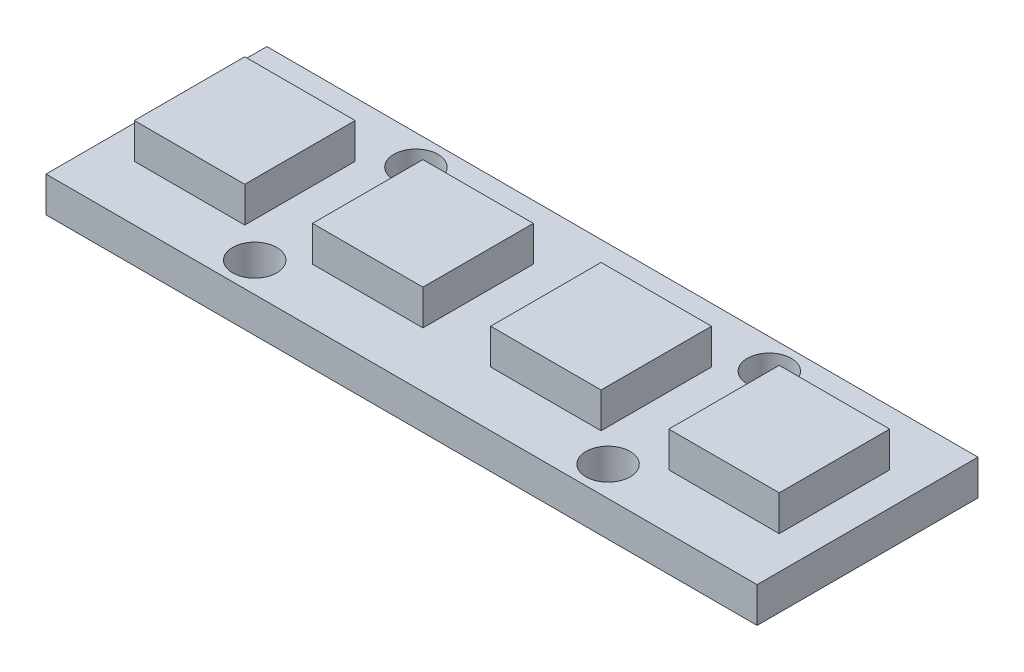
ISO-10303-21;
HEADER;
FILE_DESCRIPTION(('STEP AP214'),'2;1');
FILE_NAME('part.step','',(''),(''),'','','');
FILE_SCHEMA(('AUTOMOTIVE_DESIGN { 1 0 10303 214 1 1 1 1 }'));
ENDSEC;
DATA;
#1=APPLICATION_CONTEXT('core data for automotive mechanical design processes');
#2=APPLICATION_PROTOCOL_DEFINITION('international standard','automotive_design',2000,#1);
#3=PRODUCT_CONTEXT('',#1,'mechanical');
#4=PRODUCT('Part','Part','',(#3));
#5=PRODUCT_RELATED_PRODUCT_CATEGORY('part','',(#4));
#6=PRODUCT_DEFINITION_FORMATION('','',#4);
#7=PRODUCT_DEFINITION_CONTEXT('part definition',#1,'design');
#8=PRODUCT_DEFINITION('design','',#6,#7);
#9=PRODUCT_DEFINITION_SHAPE('','',#8);
#10=(LENGTH_UNIT() NAMED_UNIT(*) SI_UNIT(.MILLI.,.METRE.));
#11=(NAMED_UNIT(*) PLANE_ANGLE_UNIT() SI_UNIT($,.RADIAN.));
#12=(NAMED_UNIT(*) SI_UNIT($,.STERADIAN.) SOLID_ANGLE_UNIT());
#13=UNCERTAINTY_MEASURE_WITH_UNIT(LENGTH_MEASURE(1.E-05),#10,'distance_accuracy_value','');
#14=(GEOMETRIC_REPRESENTATION_CONTEXT(3) GLOBAL_UNCERTAINTY_ASSIGNED_CONTEXT((#13)) GLOBAL_UNIT_ASSIGNED_CONTEXT((#10,
#11,#12)) REPRESENTATION_CONTEXT('',''));
#15=CARTESIAN_POINT('',(0.,0.,0.));
#16=DIRECTION('',(0.,0.,1.));
#17=DIRECTION('',(1.,0.,0.));
#18=AXIS2_PLACEMENT_3D('',#15,#16,#17);
#19=CARTESIAN_POINT('',(0.,1.6,0.));
#20=DIRECTION('',(0.,1.,0.));
#21=DIRECTION('',(0.,0.,1.));
#22=AXIS2_PLACEMENT_3D('',#19,#20,#21);
#23=PLANE('',#22);
#24=CARTESIAN_POINT('',(8.,1.6,3.65));
#25=DIRECTION('',(0.,1.,0.));
#26=DIRECTION('',(0.,0.,-1.));
#27=AXIS2_PLACEMENT_3D('',#24,#25,#26);
#28=CIRCLE('',#27,1.);
#29=CARTESIAN_POINT('',(8.,1.6,2.65));
#30=VERTEX_POINT('',#29);
#31=EDGE_CURVE('E346',#30,#30,#28,.T.);
#32=ORIENTED_EDGE('',*,*,#31,.F.);
#33=EDGE_LOOP('',(#32));
#34=FACE_BOUND('',#33,.T.);
#35=CARTESIAN_POINT('',(-8.,1.6,-3.65));
#36=DIRECTION('',(0.,1.,0.));
#37=DIRECTION('',(0.,0.,1.));
#38=AXIS2_PLACEMENT_3D('',#35,#36,#37);
#39=CIRCLE('',#38,1.);
#40=CARTESIAN_POINT('',(-8.,1.6,-2.65));
#41=VERTEX_POINT('',#40);
#42=EDGE_CURVE('E360',#41,#41,#39,.T.);
#43=ORIENTED_EDGE('',*,*,#42,.F.);
#44=EDGE_LOOP('',(#43));
#45=FACE_BOUND('',#44,.T.);
#46=DIRECTION('',(0.,0.,-1.));
#47=VECTOR('',#46,1.);
#48=CARTESIAN_POINT('',(16.1,1.6,-5.));
#49=LINE('',#48,#47);
#50=CARTESIAN_POINT('',(16.1,1.6,5.));
#51=VERTEX_POINT('',#50);
#52=CARTESIAN_POINT('',(16.1,1.6,-5.));
#53=VERTEX_POINT('',#52);
#54=EDGE_CURVE('E366',#51,#53,#49,.T.);
#55=ORIENTED_EDGE('',*,*,#54,.T.);
#56=DIRECTION('',(-1.,0.,0.));
#57=VECTOR('',#56,1.);
#58=CARTESIAN_POINT('',(-16.1,1.6,-5.));
#59=LINE('',#58,#57);
#60=CARTESIAN_POINT('',(-16.1,1.6,-5.));
#61=VERTEX_POINT('',#60);
#62=EDGE_CURVE('E370',#53,#61,#59,.T.);
#63=ORIENTED_EDGE('',*,*,#62,.T.);
#64=DIRECTION('',(0.,0.,1.));
#65=VECTOR('',#64,1.);
#66=CARTESIAN_POINT('',(-16.1,1.6,-5.));
#67=LINE('',#66,#65);
#68=CARTESIAN_POINT('',(-16.1,1.6,5.));
#69=VERTEX_POINT('',#68);
#70=EDGE_CURVE('E374',#61,#69,#67,.T.);
#71=ORIENTED_EDGE('',*,*,#70,.T.);
#72=DIRECTION('',(1.,0.,0.));
#73=VECTOR('',#72,1.);
#74=CARTESIAN_POINT('',(-16.1,1.6,5.));
#75=LINE('',#74,#73);
#76=EDGE_CURVE('E376',#69,#51,#75,.T.);
#77=ORIENTED_EDGE('',*,*,#76,.T.);
#78=EDGE_LOOP('',(#55,#63,#71,#77));
#79=FACE_BOUND('',#78,.T.);
#80=CARTESIAN_POINT('',(8.,1.6,-3.65));
#81=DIRECTION('',(0.,1.,0.));
#82=DIRECTION('',(0.,0.,1.));
#83=AXIS2_PLACEMENT_3D('',#80,#81,#82);
#84=CIRCLE('',#83,1.);
#85=CARTESIAN_POINT('',(8.,1.6,-2.65));
#86=VERTEX_POINT('',#85);
#87=EDGE_CURVE('E352',#86,#86,#84,.T.);
#88=ORIENTED_EDGE('',*,*,#87,.F.);
#89=EDGE_LOOP('',(#88));
#90=FACE_BOUND('',#89,.T.);
#91=CARTESIAN_POINT('',(-8.,1.6,3.65));
#92=DIRECTION('',(0.,1.,0.));
#93=DIRECTION('',(0.,0.,-1.));
#94=AXIS2_PLACEMENT_3D('',#91,#92,#93);
#95=CIRCLE('',#94,1.);
#96=CARTESIAN_POINT('',(-8.,1.6,2.65));
#97=VERTEX_POINT('',#96);
#98=EDGE_CURVE('E340',#97,#97,#95,.T.);
#99=ORIENTED_EDGE('',*,*,#98,.F.);
#100=EDGE_LOOP('',(#99));
#101=FACE_BOUND('',#100,.T.);
#102=DIRECTION('',(-1.,0.,0.));
#103=VECTOR('',#102,1.);
#104=CARTESIAN_POINT('',(-14.6,1.6,-2.5));
#105=LINE('',#104,#103);
#106=CARTESIAN_POINT('',(-9.6,1.6,-2.5));
#107=VERTEX_POINT('',#106);
#108=CARTESIAN_POINT('',(-14.6,1.6,-2.5));
#109=VERTEX_POINT('',#108);
#110=EDGE_CURVE('E324',#107,#109,#105,.T.);
#111=ORIENTED_EDGE('',*,*,#110,.F.);
#112=DIRECTION('',(0.,0.,-1.));
#113=VECTOR('',#112,1.);
#114=CARTESIAN_POINT('',(-9.6,1.6,-2.5));
#115=LINE('',#114,#113);
#116=CARTESIAN_POINT('',(-9.6,1.6,2.5));
#117=VERTEX_POINT('',#116);
#118=EDGE_CURVE('E310',#117,#107,#115,.T.);
#119=ORIENTED_EDGE('',*,*,#118,.F.);
#120=DIRECTION('',(1.,0.,0.));
#121=VECTOR('',#120,1.);
#122=CARTESIAN_POINT('',(-14.6,1.6,2.5));
#123=LINE('',#122,#121);
#124=CARTESIAN_POINT('',(-14.6,1.6,2.5));
#125=VERTEX_POINT('',#124);
#126=EDGE_CURVE('E315',#125,#117,#123,.T.);
#127=ORIENTED_EDGE('',*,*,#126,.F.);
#128=DIRECTION('',(0.,0.,1.));
#129=VECTOR('',#128,1.);
#130=CARTESIAN_POINT('',(-14.6,1.6,-2.5));
#131=LINE('',#130,#129);
#132=EDGE_CURVE('E326',#109,#125,#131,.T.);
#133=ORIENTED_EDGE('',*,*,#132,.F.);
#134=EDGE_LOOP('',(#111,#119,#127,#133));
#135=FACE_BOUND('',#134,.T.);
#136=DIRECTION('',(-1.,0.,0.));
#137=VECTOR('',#136,1.);
#138=CARTESIAN_POINT('',(-6.53333333333334,1.6,-2.5));
#139=LINE('',#138,#137);
#140=CARTESIAN_POINT('',(-1.53333333333334,1.6,-2.5));
#141=VERTEX_POINT('',#140);
#142=CARTESIAN_POINT('',(-6.53333333333334,1.6,-2.5));
#143=VERTEX_POINT('',#142);
#144=EDGE_CURVE('E288',#141,#143,#139,.T.);
#145=ORIENTED_EDGE('',*,*,#144,.F.);
#146=DIRECTION('',(0.,0.,-1.));
#147=VECTOR('',#146,1.);
#148=CARTESIAN_POINT('',(-1.53333333333334,1.6,-2.5));
#149=LINE('',#148,#147);
#150=CARTESIAN_POINT('',(-1.53333333333334,1.6,2.5));
#151=VERTEX_POINT('',#150);
#152=EDGE_CURVE('E269',#151,#141,#149,.T.);
#153=ORIENTED_EDGE('',*,*,#152,.F.);
#154=DIRECTION('',(1.,0.,0.));
#155=VECTOR('',#154,1.);
#156=CARTESIAN_POINT('',(-6.53333333333334,1.6,2.5));
#157=LINE('',#156,#155);
#158=CARTESIAN_POINT('',(-6.53333333333334,1.6,2.5));
#159=VERTEX_POINT('',#158);
#160=EDGE_CURVE('E275',#159,#151,#157,.T.);
#161=ORIENTED_EDGE('',*,*,#160,.F.);
#162=DIRECTION('',(0.,0.,1.));
#163=VECTOR('',#162,1.);
#164=CARTESIAN_POINT('',(-6.53333333333334,1.6,-2.5));
#165=LINE('',#164,#163);
#166=EDGE_CURVE('E291',#143,#159,#165,.T.);
#167=ORIENTED_EDGE('',*,*,#166,.F.);
#168=EDGE_LOOP('',(#145,#153,#161,#167));
#169=FACE_BOUND('',#168,.T.);
#170=DIRECTION('',(-1.,0.,0.));
#171=VECTOR('',#170,1.);
#172=CARTESIAN_POINT('',(1.53333333333333,1.6,-2.5));
#173=LINE('',#172,#171);
#174=CARTESIAN_POINT('',(6.53333333333333,1.6,-2.5));
#175=VERTEX_POINT('',#174);
#176=CARTESIAN_POINT('',(1.53333333333333,1.6,-2.5));
#177=VERTEX_POINT('',#176);
#178=EDGE_CURVE('E230',#175,#177,#173,.T.);
#179=ORIENTED_EDGE('',*,*,#178,.F.);
#180=DIRECTION('',(0.,0.,-1.));
#181=VECTOR('',#180,1.);
#182=CARTESIAN_POINT('',(6.53333333333333,1.6,-2.5));
#183=LINE('',#182,#181);
#184=CARTESIAN_POINT('',(6.53333333333333,1.6,2.5));
#185=VERTEX_POINT('',#184);
#186=EDGE_CURVE('E225',#185,#175,#183,.T.);
#187=ORIENTED_EDGE('',*,*,#186,.F.);
#188=DIRECTION('',(1.,0.,0.));
#189=VECTOR('',#188,1.);
#190=CARTESIAN_POINT('',(1.53333333333333,1.6,2.5));
#191=LINE('',#190,#189);
#192=CARTESIAN_POINT('',(1.53333333333333,1.6,2.5));
#193=VERTEX_POINT('',#192);
#194=EDGE_CURVE('E241',#193,#185,#191,.T.);
#195=ORIENTED_EDGE('',*,*,#194,.F.);
#196=DIRECTION('',(0.,0.,1.));
#197=VECTOR('',#196,1.);
#198=CARTESIAN_POINT('',(1.53333333333333,1.6,-2.5));
#199=LINE('',#198,#197);
#200=EDGE_CURVE('E253',#177,#193,#199,.T.);
#201=ORIENTED_EDGE('',*,*,#200,.F.);
#202=EDGE_LOOP('',(#179,#187,#195,#201));
#203=FACE_BOUND('',#202,.T.);
#204=DIRECTION('',(-1.,0.,0.));
#205=VECTOR('',#204,1.);
#206=CARTESIAN_POINT('',(9.59999999999999,1.6,-2.5));
#207=LINE('',#206,#205);
#208=CARTESIAN_POINT('',(14.6,1.6,-2.5));
#209=VERTEX_POINT('',#208);
#210=CARTESIAN_POINT('',(9.59999999999999,1.6,-2.5));
#211=VERTEX_POINT('',#210);
#212=EDGE_CURVE('E720',#209,#211,#207,.T.);
#213=ORIENTED_EDGE('',*,*,#212,.F.);
#214=DIRECTION('',(0.,0.,-1.));
#215=VECTOR('',#214,1.);
#216=CARTESIAN_POINT('',(14.6,1.6,-2.5));
#217=LINE('',#216,#215);
#218=CARTESIAN_POINT('',(14.6,1.6,2.5));
#219=VERTEX_POINT('',#218);
#220=EDGE_CURVE('E222',#219,#209,#217,.T.);
#221=ORIENTED_EDGE('',*,*,#220,.F.);
#222=DIRECTION('',(1.,0.,0.));
#223=VECTOR('',#222,1.);
#224=CARTESIAN_POINT('',(9.59999999999999,1.6,2.5));
#225=LINE('',#224,#223);
#226=CARTESIAN_POINT('',(9.59999999999999,1.6,2.5));
#227=VERTEX_POINT('',#226);
#228=EDGE_CURVE('E218',#227,#219,#225,.T.);
#229=ORIENTED_EDGE('',*,*,#228,.F.);
#230=DIRECTION('',(0.,0.,1.));
#231=VECTOR('',#230,1.);
#232=CARTESIAN_POINT('',(9.59999999999999,1.6,-2.5));
#233=LINE('',#232,#231);
#234=EDGE_CURVE('E717',#211,#227,#233,.T.);
#235=ORIENTED_EDGE('',*,*,#234,.F.);
#236=EDGE_LOOP('',(#213,#221,#229,#235));
#237=FACE_BOUND('',#236,.T.);
#238=ADVANCED_FACE('F42',(#34,#45,#79,#90,#101,#135,#169,#203,#237),#23,.T.);
#239=CARTESIAN_POINT('',(0.,0.,0.));
#240=DIRECTION('',(0.,1.,0.));
#241=DIRECTION('',(0.,0.,1.));
#242=AXIS2_PLACEMENT_3D('',#239,#240,#241);
#243=PLANE('',#242);
#244=DIRECTION('',(0.,0.,-1.));
#245=VECTOR('',#244,1.);
#246=CARTESIAN_POINT('',(16.1,0.,-5.));
#247=LINE('',#246,#245);
#248=CARTESIAN_POINT('',(16.1,0.,5.));
#249=VERTEX_POINT('',#248);
#250=CARTESIAN_POINT('',(16.1,0.,-5.));
#251=VERTEX_POINT('',#250);
#252=EDGE_CURVE('E363',#249,#251,#247,.T.);
#253=ORIENTED_EDGE('',*,*,#252,.F.);
#254=DIRECTION('',(1.,0.,0.));
#255=VECTOR('',#254,1.);
#256=CARTESIAN_POINT('',(-16.1,0.,5.));
#257=LINE('',#256,#255);
#258=CARTESIAN_POINT('',(-16.1,0.,5.));
#259=VERTEX_POINT('',#258);
#260=EDGE_CURVE('E371',#259,#249,#257,.T.);
#261=ORIENTED_EDGE('',*,*,#260,.F.);
#262=DIRECTION('',(0.,0.,1.));
#263=VECTOR('',#262,1.);
#264=CARTESIAN_POINT('',(-16.1,0.,-5.));
#265=LINE('',#264,#263);
#266=CARTESIAN_POINT('',(-16.1,0.,-5.));
#267=VERTEX_POINT('',#266);
#268=EDGE_CURVE('E385',#267,#259,#265,.T.);
#269=ORIENTED_EDGE('',*,*,#268,.F.);
#270=DIRECTION('',(-1.,0.,0.));
#271=VECTOR('',#270,1.);
#272=CARTESIAN_POINT('',(-16.1,0.,-5.));
#273=LINE('',#272,#271);
#274=EDGE_CURVE('E382',#251,#267,#273,.T.);
#275=ORIENTED_EDGE('',*,*,#274,.F.);
#276=EDGE_LOOP('',(#253,#261,#269,#275));
#277=FACE_BOUND('',#276,.T.);
#278=CARTESIAN_POINT('',(-8.,0.,-3.65));
#279=DIRECTION('',(0.,1.,0.));
#280=DIRECTION('',(0.,0.,1.));
#281=AXIS2_PLACEMENT_3D('',#278,#279,#280);
#282=CIRCLE('',#281,1.);
#283=CARTESIAN_POINT('',(-8.,0.,-2.65));
#284=VERTEX_POINT('',#283);
#285=EDGE_CURVE('E356',#284,#284,#282,.T.);
#286=ORIENTED_EDGE('',*,*,#285,.T.);
#287=EDGE_LOOP('',(#286));
#288=FACE_BOUND('',#287,.T.);
#289=CARTESIAN_POINT('',(8.,0.,-3.65));
#290=DIRECTION('',(0.,1.,0.));
#291=DIRECTION('',(0.,0.,1.));
#292=AXIS2_PLACEMENT_3D('',#289,#290,#291);
#293=CIRCLE('',#292,1.);
#294=CARTESIAN_POINT('',(8.,0.,-2.65));
#295=VERTEX_POINT('',#294);
#296=EDGE_CURVE('E349',#295,#295,#293,.T.);
#297=ORIENTED_EDGE('',*,*,#296,.T.);
#298=EDGE_LOOP('',(#297));
#299=FACE_BOUND('',#298,.T.);
#300=CARTESIAN_POINT('',(8.,0.,3.65));
#301=DIRECTION('',(0.,1.,0.));
#302=DIRECTION('',(0.,0.,-1.));
#303=AXIS2_PLACEMENT_3D('',#300,#301,#302);
#304=CIRCLE('',#303,1.);
#305=CARTESIAN_POINT('',(8.,0.,2.65));
#306=VERTEX_POINT('',#305);
#307=EDGE_CURVE('E343',#306,#306,#304,.T.);
#308=ORIENTED_EDGE('',*,*,#307,.T.);
#309=EDGE_LOOP('',(#308));
#310=FACE_BOUND('',#309,.T.);
#311=CARTESIAN_POINT('',(-8.,0.,3.65));
#312=DIRECTION('',(0.,1.,0.));
#313=DIRECTION('',(0.,0.,-1.));
#314=AXIS2_PLACEMENT_3D('',#311,#312,#313);
#315=CIRCLE('',#314,1.);
#316=CARTESIAN_POINT('',(-8.,0.,2.65));
#317=VERTEX_POINT('',#316);
#318=EDGE_CURVE('E339',#317,#317,#315,.T.);
#319=ORIENTED_EDGE('',*,*,#318,.T.);
#320=EDGE_LOOP('',(#319));
#321=FACE_BOUND('',#320,.T.);
#322=ADVANCED_FACE('F403',(#277,#288,#299,#310,#321),#243,.F.);
#323=CARTESIAN_POINT('',(16.1,1.6,-5.));
#324=DIRECTION('',(-1.,0.,0.));
#325=DIRECTION('',(0.,0.,1.));
#326=AXIS2_PLACEMENT_3D('',#323,#324,#325);
#327=PLANE('',#326);
#328=ORIENTED_EDGE('',*,*,#252,.T.);
#329=DIRECTION('',(0.,-1.,0.));
#330=VECTOR('',#329,1.);
#331=CARTESIAN_POINT('',(16.1,1.6,-5.));
#332=LINE('',#331,#330);
#333=EDGE_CURVE('E11',#53,#251,#332,.T.);
#334=ORIENTED_EDGE('',*,*,#333,.F.);
#335=ORIENTED_EDGE('',*,*,#54,.F.);
#336=DIRECTION('',(0.,-1.,0.));
#337=VECTOR('',#336,1.);
#338=CARTESIAN_POINT('',(16.1,1.6,5.));
#339=LINE('',#338,#337);
#340=EDGE_CURVE('E378',#51,#249,#339,.T.);
#341=ORIENTED_EDGE('',*,*,#340,.T.);
#342=EDGE_LOOP('',(#328,#334,#335,#341));
#343=FACE_BOUND('',#342,.T.);
#344=ADVANCED_FACE('F44',(#343),#327,.F.);
#345=CARTESIAN_POINT('',(-16.1,1.6,-5.));
#346=DIRECTION('',(0.,0.,1.));
#347=DIRECTION('',(1.,0.,0.));
#348=AXIS2_PLACEMENT_3D('',#345,#346,#347);
#349=PLANE('',#348);
#350=ORIENTED_EDGE('',*,*,#274,.T.);
#351=DIRECTION('',(0.,-1.,0.));
#352=VECTOR('',#351,1.);
#353=CARTESIAN_POINT('',(-16.1,1.6,-5.));
#354=LINE('',#353,#352);
#355=EDGE_CURVE('E51',#61,#267,#354,.T.);
#356=ORIENTED_EDGE('',*,*,#355,.F.);
#357=ORIENTED_EDGE('',*,*,#62,.F.);
#358=ORIENTED_EDGE('',*,*,#333,.T.);
#359=EDGE_LOOP('',(#350,#356,#357,#358));
#360=FACE_BOUND('',#359,.T.);
#361=ADVANCED_FACE('F414',(#360),#349,.F.);
#362=CARTESIAN_POINT('',(-16.1,1.6,-5.));
#363=DIRECTION('',(1.,0.,0.));
#364=DIRECTION('',(0.,0.,-1.));
#365=AXIS2_PLACEMENT_3D('',#362,#363,#364);
#366=PLANE('',#365);
#367=ORIENTED_EDGE('',*,*,#268,.T.);
#368=DIRECTION('',(0.,-1.,0.));
#369=VECTOR('',#368,1.);
#370=CARTESIAN_POINT('',(-16.1,1.6,5.));
#371=LINE('',#370,#369);
#372=EDGE_CURVE('E390',#69,#259,#371,.T.);
#373=ORIENTED_EDGE('',*,*,#372,.F.);
#374=ORIENTED_EDGE('',*,*,#70,.F.);
#375=ORIENTED_EDGE('',*,*,#355,.T.);
#376=EDGE_LOOP('',(#367,#373,#374,#375));
#377=FACE_BOUND('',#376,.T.);
#378=ADVANCED_FACE('F397',(#377),#366,.F.);
#379=CARTESIAN_POINT('',(-16.1,1.6,5.));
#380=DIRECTION('',(0.,0.,-1.));
#381=DIRECTION('',(-1.,0.,0.));
#382=AXIS2_PLACEMENT_3D('',#379,#380,#381);
#383=PLANE('',#382);
#384=ORIENTED_EDGE('',*,*,#260,.T.);
#385=ORIENTED_EDGE('',*,*,#340,.F.);
#386=ORIENTED_EDGE('',*,*,#76,.F.);
#387=ORIENTED_EDGE('',*,*,#372,.T.);
#388=EDGE_LOOP('',(#384,#385,#386,#387));
#389=FACE_BOUND('',#388,.T.);
#390=ADVANCED_FACE('F407',(#389),#383,.F.);
#391=CARTESIAN_POINT('',(-8.,1.6,-3.65));
#392=DIRECTION('',(0.,-1.,0.));
#393=DIRECTION('',(0.,0.,-1.));
#394=AXIS2_PLACEMENT_3D('',#391,#392,#393);
#395=CYLINDRICAL_SURFACE('',#394,1.);
#396=ORIENTED_EDGE('',*,*,#42,.T.);
#397=EDGE_LOOP('',(#396));
#398=FACE_BOUND('',#397,.T.);
#399=ORIENTED_EDGE('',*,*,#285,.F.);
#400=EDGE_LOOP('',(#399));
#401=FACE_BOUND('',#400,.T.);
#402=ADVANCED_FACE('F431',(#398,#401),#395,.F.);
#403=CARTESIAN_POINT('',(8.,1.6,-3.65));
#404=DIRECTION('',(0.,-1.,0.));
#405=DIRECTION('',(0.,0.,-1.));
#406=AXIS2_PLACEMENT_3D('',#403,#404,#405);
#407=CYLINDRICAL_SURFACE('',#406,1.);
#408=ORIENTED_EDGE('',*,*,#87,.T.);
#409=EDGE_LOOP('',(#408));
#410=FACE_BOUND('',#409,.T.);
#411=ORIENTED_EDGE('',*,*,#296,.F.);
#412=EDGE_LOOP('',(#411));
#413=FACE_BOUND('',#412,.T.);
#414=ADVANCED_FACE('F438',(#410,#413),#407,.F.);
#415=CARTESIAN_POINT('',(8.,1.6,3.65));
#416=DIRECTION('',(0.,-1.,0.));
#417=DIRECTION('',(0.,0.,-1.));
#418=AXIS2_PLACEMENT_3D('',#415,#416,#417);
#419=CYLINDRICAL_SURFACE('',#418,1.);
#420=ORIENTED_EDGE('',*,*,#31,.T.);
#421=EDGE_LOOP('',(#420));
#422=FACE_BOUND('',#421,.T.);
#423=ORIENTED_EDGE('',*,*,#307,.F.);
#424=EDGE_LOOP('',(#423));
#425=FACE_BOUND('',#424,.T.);
#426=ADVANCED_FACE('F443',(#422,#425),#419,.F.);
#427=CARTESIAN_POINT('',(-8.,1.6,3.65));
#428=DIRECTION('',(0.,-1.,0.));
#429=DIRECTION('',(0.,0.,-1.));
#430=AXIS2_PLACEMENT_3D('',#427,#428,#429);
#431=CYLINDRICAL_SURFACE('',#430,1.);
#432=ORIENTED_EDGE('',*,*,#98,.T.);
#433=EDGE_LOOP('',(#432));
#434=FACE_BOUND('',#433,.T.);
#435=ORIENTED_EDGE('',*,*,#318,.F.);
#436=EDGE_LOOP('',(#435));
#437=FACE_BOUND('',#436,.T.);
#438=ADVANCED_FACE('F455',(#434,#437),#431,.F.);
#439=CARTESIAN_POINT('',(-9.6,3.2,-2.5));
#440=DIRECTION('',(-1.,0.,0.));
#441=DIRECTION('',(0.,0.,1.));
#442=AXIS2_PLACEMENT_3D('',#439,#440,#441);
#443=PLANE('',#442);
#444=ORIENTED_EDGE('',*,*,#118,.T.);
#445=DIRECTION('',(0.,-1.,0.));
#446=VECTOR('',#445,1.);
#447=CARTESIAN_POINT('',(-9.6,3.2,-2.5));
#448=LINE('',#447,#446);
#449=CARTESIAN_POINT('',(-9.6,3.2,-2.5));
#450=VERTEX_POINT('',#449);
#451=EDGE_CURVE('E337',#450,#107,#448,.T.);
#452=ORIENTED_EDGE('',*,*,#451,.F.);
#453=DIRECTION('',(0.,0.,-1.));
#454=VECTOR('',#453,1.);
#455=CARTESIAN_POINT('',(-9.6,3.2,-2.5));
#456=LINE('',#455,#454);
#457=CARTESIAN_POINT('',(-9.6,3.2,2.5));
#458=VERTEX_POINT('',#457);
#459=EDGE_CURVE('E311',#458,#450,#456,.T.);
#460=ORIENTED_EDGE('',*,*,#459,.F.);
#461=DIRECTION('',(0.,-1.,0.));
#462=VECTOR('',#461,1.);
#463=CARTESIAN_POINT('',(-9.6,3.2,2.5));
#464=LINE('',#463,#462);
#465=EDGE_CURVE('E321',#458,#117,#464,.T.);
#466=ORIENTED_EDGE('',*,*,#465,.T.);
#467=EDGE_LOOP('',(#444,#452,#460,#466));
#468=FACE_BOUND('',#467,.T.);
#469=ADVANCED_FACE('F457',(#468),#443,.F.);
#470=CARTESIAN_POINT('',(-14.6,3.2,-2.5));
#471=DIRECTION('',(0.,0.,1.));
#472=DIRECTION('',(1.,0.,0.));
#473=AXIS2_PLACEMENT_3D('',#470,#471,#472);
#474=PLANE('',#473);
#475=ORIENTED_EDGE('',*,*,#110,.T.);
#476=DIRECTION('',(0.,-1.,0.));
#477=VECTOR('',#476,1.);
#478=CARTESIAN_POINT('',(-14.6,3.2,-2.5));
#479=LINE('',#478,#477);
#480=CARTESIAN_POINT('',(-14.6,3.2,-2.5));
#481=VERTEX_POINT('',#480);
#482=EDGE_CURVE('E334',#481,#109,#479,.T.);
#483=ORIENTED_EDGE('',*,*,#482,.F.);
#484=DIRECTION('',(-1.,0.,0.));
#485=VECTOR('',#484,1.);
#486=CARTESIAN_POINT('',(-14.6,3.2,-2.5));
#487=LINE('',#486,#485);
#488=EDGE_CURVE('E314',#450,#481,#487,.T.);
#489=ORIENTED_EDGE('',*,*,#488,.F.);
#490=ORIENTED_EDGE('',*,*,#451,.T.);
#491=EDGE_LOOP('',(#475,#483,#489,#490));
#492=FACE_BOUND('',#491,.T.);
#493=ADVANCED_FACE('F464',(#492),#474,.F.);
#494=CARTESIAN_POINT('',(-14.6,3.2,-2.5));
#495=DIRECTION('',(1.,0.,0.));
#496=DIRECTION('',(0.,0.,-1.));
#497=AXIS2_PLACEMENT_3D('',#494,#495,#496);
#498=PLANE('',#497);
#499=ORIENTED_EDGE('',*,*,#132,.T.);
#500=DIRECTION('',(0.,-1.,0.));
#501=VECTOR('',#500,1.);
#502=CARTESIAN_POINT('',(-14.6,3.2,2.5));
#503=LINE('',#502,#501);
#504=CARTESIAN_POINT('',(-14.6,3.2,2.5));
#505=VERTEX_POINT('',#504);
#506=EDGE_CURVE('E332',#505,#125,#503,.T.);
#507=ORIENTED_EDGE('',*,*,#506,.F.);
#508=DIRECTION('',(0.,0.,1.));
#509=VECTOR('',#508,1.);
#510=CARTESIAN_POINT('',(-14.6,3.2,-2.5));
#511=LINE('',#510,#509);
#512=EDGE_CURVE('E317',#481,#505,#511,.T.);
#513=ORIENTED_EDGE('',*,*,#512,.F.);
#514=ORIENTED_EDGE('',*,*,#482,.T.);
#515=EDGE_LOOP('',(#499,#507,#513,#514));
#516=FACE_BOUND('',#515,.T.);
#517=ADVANCED_FACE('F472',(#516),#498,.F.);
#518=CARTESIAN_POINT('',(-14.6,3.2,2.5));
#519=DIRECTION('',(0.,0.,-1.));
#520=DIRECTION('',(-1.,0.,0.));
#521=AXIS2_PLACEMENT_3D('',#518,#519,#520);
#522=PLANE('',#521);
#523=ORIENTED_EDGE('',*,*,#126,.T.);
#524=ORIENTED_EDGE('',*,*,#465,.F.);
#525=DIRECTION('',(1.,0.,0.));
#526=VECTOR('',#525,1.);
#527=CARTESIAN_POINT('',(-14.6,3.2,2.5));
#528=LINE('',#527,#526);
#529=EDGE_CURVE('E319',#505,#458,#528,.T.);
#530=ORIENTED_EDGE('',*,*,#529,.F.);
#531=ORIENTED_EDGE('',*,*,#506,.T.);
#532=EDGE_LOOP('',(#523,#524,#530,#531));
#533=FACE_BOUND('',#532,.T.);
#534=ADVANCED_FACE('F476',(#533),#522,.F.);
#535=CARTESIAN_POINT('',(0.,3.2,0.));
#536=DIRECTION('',(0.,1.,0.));
#537=DIRECTION('',(0.,0.,1.));
#538=AXIS2_PLACEMENT_3D('',#535,#536,#537);
#539=PLANE('',#538);
#540=ORIENTED_EDGE('',*,*,#459,.T.);
#541=ORIENTED_EDGE('',*,*,#488,.T.);
#542=ORIENTED_EDGE('',*,*,#512,.T.);
#543=ORIENTED_EDGE('',*,*,#529,.T.);
#544=EDGE_LOOP('',(#540,#541,#542,#543));
#545=FACE_BOUND('',#544,.T.);
#546=ADVANCED_FACE('F480',(#545),#539,.T.);
#547=CARTESIAN_POINT('',(-1.53333333333334,3.2,-2.5));
#548=DIRECTION('',(-1.,0.,0.));
#549=DIRECTION('',(0.,0.,1.));
#550=AXIS2_PLACEMENT_3D('',#547,#548,#549);
#551=PLANE('',#550);
#552=ORIENTED_EDGE('',*,*,#152,.T.);
#553=DIRECTION('',(0.,-1.,0.));
#554=VECTOR('',#553,1.);
#555=CARTESIAN_POINT('',(-1.53333333333334,3.2,-2.5));
#556=LINE('',#555,#554);
#557=CARTESIAN_POINT('',(-1.53333333333334,3.2,-2.5));
#558=VERTEX_POINT('',#557);
#559=EDGE_CURVE('E307',#558,#141,#556,.T.);
#560=ORIENTED_EDGE('',*,*,#559,.F.);
#561=DIRECTION('',(0.,0.,-1.));
#562=VECTOR('',#561,1.);
#563=CARTESIAN_POINT('',(-1.53333333333334,3.2,-2.5));
#564=LINE('',#563,#562);
#565=CARTESIAN_POINT('',(-1.53333333333334,3.2,2.5));
#566=VERTEX_POINT('',#565);
#567=EDGE_CURVE('E270',#566,#558,#564,.T.);
#568=ORIENTED_EDGE('',*,*,#567,.F.);
#569=DIRECTION('',(0.,-1.,0.));
#570=VECTOR('',#569,1.);
#571=CARTESIAN_POINT('',(-1.53333333333334,3.2,2.5));
#572=LINE('',#571,#570);
#573=EDGE_CURVE('E284',#566,#151,#572,.T.);
#574=ORIENTED_EDGE('',*,*,#573,.T.);
#575=EDGE_LOOP('',(#552,#560,#568,#574));
#576=FACE_BOUND('',#575,.T.);
#577=ADVANCED_FACE('F484',(#576),#551,.F.);
#578=CARTESIAN_POINT('',(-6.53333333333334,3.2,-2.5));
#579=DIRECTION('',(0.,0.,1.));
#580=DIRECTION('',(1.,0.,0.));
#581=AXIS2_PLACEMENT_3D('',#578,#579,#580);
#582=PLANE('',#581);
#583=ORIENTED_EDGE('',*,*,#144,.T.);
#584=DIRECTION('',(0.,-1.,0.));
#585=VECTOR('',#584,1.);
#586=CARTESIAN_POINT('',(-6.53333333333334,3.2,-2.5));
#587=LINE('',#586,#585);
#588=CARTESIAN_POINT('',(-6.53333333333334,3.2,-2.5));
#589=VERTEX_POINT('',#588);
#590=EDGE_CURVE('E303',#589,#143,#587,.T.);
#591=ORIENTED_EDGE('',*,*,#590,.F.);
#592=DIRECTION('',(-1.,0.,0.));
#593=VECTOR('',#592,1.);
#594=CARTESIAN_POINT('',(-6.53333333333334,3.2,-2.5));
#595=LINE('',#594,#593);
#596=EDGE_CURVE('E274',#558,#589,#595,.T.);
#597=ORIENTED_EDGE('',*,*,#596,.F.);
#598=ORIENTED_EDGE('',*,*,#559,.T.);
#599=EDGE_LOOP('',(#583,#591,#597,#598));
#600=FACE_BOUND('',#599,.T.);
#601=ADVANCED_FACE('F488',(#600),#582,.F.);
#602=CARTESIAN_POINT('',(-6.53333333333334,3.2,-2.5));
#603=DIRECTION('',(1.,0.,0.));
#604=DIRECTION('',(0.,0.,-1.));
#605=AXIS2_PLACEMENT_3D('',#602,#603,#604);
#606=PLANE('',#605);
#607=ORIENTED_EDGE('',*,*,#166,.T.);
#608=DIRECTION('',(0.,-1.,0.));
#609=VECTOR('',#608,1.);
#610=CARTESIAN_POINT('',(-6.53333333333334,3.2,2.5));
#611=LINE('',#610,#609);
#612=CARTESIAN_POINT('',(-6.53333333333334,3.2,2.5));
#613=VERTEX_POINT('',#612);
#614=EDGE_CURVE('E300',#613,#159,#611,.T.);
#615=ORIENTED_EDGE('',*,*,#614,.F.);
#616=DIRECTION('',(0.,0.,1.));
#617=VECTOR('',#616,1.);
#618=CARTESIAN_POINT('',(-6.53333333333334,3.2,-2.5));
#619=LINE('',#618,#617);
#620=EDGE_CURVE('E278',#589,#613,#619,.T.);
#621=ORIENTED_EDGE('',*,*,#620,.F.);
#622=ORIENTED_EDGE('',*,*,#590,.T.);
#623=EDGE_LOOP('',(#607,#615,#621,#622));
#624=FACE_BOUND('',#623,.T.);
#625=ADVANCED_FACE('F492',(#624),#606,.F.);
#626=CARTESIAN_POINT('',(-6.53333333333334,3.2,2.5));
#627=DIRECTION('',(0.,0.,-1.));
#628=DIRECTION('',(-1.,0.,0.));
#629=AXIS2_PLACEMENT_3D('',#626,#627,#628);
#630=PLANE('',#629);
#631=ORIENTED_EDGE('',*,*,#160,.T.);
#632=ORIENTED_EDGE('',*,*,#573,.F.);
#633=DIRECTION('',(1.,0.,0.));
#634=VECTOR('',#633,1.);
#635=CARTESIAN_POINT('',(-6.53333333333334,3.2,2.5));
#636=LINE('',#635,#634);
#637=EDGE_CURVE('E281',#613,#566,#636,.T.);
#638=ORIENTED_EDGE('',*,*,#637,.F.);
#639=ORIENTED_EDGE('',*,*,#614,.T.);
#640=EDGE_LOOP('',(#631,#632,#638,#639));
#641=FACE_BOUND('',#640,.T.);
#642=ADVANCED_FACE('F496',(#641),#630,.F.);
#643=CARTESIAN_POINT('',(0.,3.2,0.));
#644=DIRECTION('',(0.,1.,0.));
#645=DIRECTION('',(0.,0.,1.));
#646=AXIS2_PLACEMENT_3D('',#643,#644,#645);
#647=PLANE('',#646);
#648=ORIENTED_EDGE('',*,*,#567,.T.);
#649=ORIENTED_EDGE('',*,*,#596,.T.);
#650=ORIENTED_EDGE('',*,*,#620,.T.);
#651=ORIENTED_EDGE('',*,*,#637,.T.);
#652=EDGE_LOOP('',(#648,#649,#650,#651));
#653=FACE_BOUND('',#652,.T.);
#654=ADVANCED_FACE('F500',(#653),#647,.T.);
#655=CARTESIAN_POINT('',(6.53333333333333,3.2,-2.5));
#656=DIRECTION('',(-1.,0.,0.));
#657=DIRECTION('',(0.,0.,1.));
#658=AXIS2_PLACEMENT_3D('',#655,#656,#657);
#659=PLANE('',#658);
#660=ORIENTED_EDGE('',*,*,#186,.T.);
#661=DIRECTION('',(0.,-1.,0.));
#662=VECTOR('',#661,1.);
#663=CARTESIAN_POINT('',(6.53333333333333,3.2,-2.5));
#664=LINE('',#663,#662);
#665=CARTESIAN_POINT('',(6.53333333333333,3.2,-2.5));
#666=VERTEX_POINT('',#665);
#667=EDGE_CURVE('E266',#666,#175,#664,.T.);
#668=ORIENTED_EDGE('',*,*,#667,.F.);
#669=DIRECTION('',(0.,0.,-1.));
#670=VECTOR('',#669,1.);
#671=CARTESIAN_POINT('',(6.53333333333333,3.2,-2.5));
#672=LINE('',#671,#670);
#673=CARTESIAN_POINT('',(6.53333333333333,3.2,2.5));
#674=VERTEX_POINT('',#673);
#675=EDGE_CURVE('E236',#674,#666,#672,.T.);
#676=ORIENTED_EDGE('',*,*,#675,.F.);
#677=DIRECTION('',(0.,-1.,0.));
#678=VECTOR('',#677,1.);
#679=CARTESIAN_POINT('',(6.53333333333333,3.2,2.5));
#680=LINE('',#679,#678);
#681=EDGE_CURVE('E249',#674,#185,#680,.T.);
#682=ORIENTED_EDGE('',*,*,#681,.T.);
#683=EDGE_LOOP('',(#660,#668,#676,#682));
#684=FACE_BOUND('',#683,.T.);
#685=ADVANCED_FACE('F504',(#684),#659,.F.);
#686=CARTESIAN_POINT('',(1.53333333333333,3.2,-2.5));
#687=DIRECTION('',(0.,0.,1.));
#688=DIRECTION('',(1.,0.,0.));
#689=AXIS2_PLACEMENT_3D('',#686,#687,#688);
#690=PLANE('',#689);
#691=ORIENTED_EDGE('',*,*,#178,.T.);
#692=DIRECTION('',(0.,-1.,0.));
#693=VECTOR('',#692,1.);
#694=CARTESIAN_POINT('',(1.53333333333333,3.2,-2.5));
#695=LINE('',#694,#693);
#696=CARTESIAN_POINT('',(1.53333333333333,3.2,-2.5));
#697=VERTEX_POINT('',#696);
#698=EDGE_CURVE('E262',#697,#177,#695,.T.);
#699=ORIENTED_EDGE('',*,*,#698,.F.);
#700=DIRECTION('',(-1.,0.,0.));
#701=VECTOR('',#700,1.);
#702=CARTESIAN_POINT('',(1.53333333333333,3.2,-2.5));
#703=LINE('',#702,#701);
#704=EDGE_CURVE('E240',#666,#697,#703,.T.);
#705=ORIENTED_EDGE('',*,*,#704,.F.);
#706=ORIENTED_EDGE('',*,*,#667,.T.);
#707=EDGE_LOOP('',(#691,#699,#705,#706));
#708=FACE_BOUND('',#707,.T.);
#709=ADVANCED_FACE('F508',(#708),#690,.F.);
#710=CARTESIAN_POINT('',(1.53333333333333,3.2,-2.5));
#711=DIRECTION('',(1.,0.,0.));
#712=DIRECTION('',(0.,0.,-1.));
#713=AXIS2_PLACEMENT_3D('',#710,#711,#712);
#714=PLANE('',#713);
#715=ORIENTED_EDGE('',*,*,#200,.T.);
#716=DIRECTION('',(0.,-1.,0.));
#717=VECTOR('',#716,1.);
#718=CARTESIAN_POINT('',(1.53333333333333,3.2,2.5));
#719=LINE('',#718,#717);
#720=CARTESIAN_POINT('',(1.53333333333333,3.2,2.5));
#721=VERTEX_POINT('',#720);
#722=EDGE_CURVE('E68',#721,#193,#719,.T.);
#723=ORIENTED_EDGE('',*,*,#722,.F.);
#724=DIRECTION('',(0.,0.,1.));
#725=VECTOR('',#724,1.);
#726=CARTESIAN_POINT('',(1.53333333333333,3.2,-2.5));
#727=LINE('',#726,#725);
#728=EDGE_CURVE('E244',#697,#721,#727,.T.);
#729=ORIENTED_EDGE('',*,*,#728,.F.);
#730=ORIENTED_EDGE('',*,*,#698,.T.);
#731=EDGE_LOOP('',(#715,#723,#729,#730));
#732=FACE_BOUND('',#731,.T.);
#733=ADVANCED_FACE('F512',(#732),#714,.F.);
#734=CARTESIAN_POINT('',(1.53333333333333,3.2,2.5));
#735=DIRECTION('',(0.,0.,-1.));
#736=DIRECTION('',(-1.,0.,0.));
#737=AXIS2_PLACEMENT_3D('',#734,#735,#736);
#738=PLANE('',#737);
#739=ORIENTED_EDGE('',*,*,#194,.T.);
#740=ORIENTED_EDGE('',*,*,#681,.F.);
#741=DIRECTION('',(1.,0.,0.));
#742=VECTOR('',#741,1.);
#743=CARTESIAN_POINT('',(1.53333333333333,3.2,2.5));
#744=LINE('',#743,#742);
#745=EDGE_CURVE('E247',#721,#674,#744,.T.);
#746=ORIENTED_EDGE('',*,*,#745,.F.);
#747=ORIENTED_EDGE('',*,*,#722,.T.);
#748=EDGE_LOOP('',(#739,#740,#746,#747));
#749=FACE_BOUND('',#748,.T.);
#750=ADVANCED_FACE('F516',(#749),#738,.F.);
#751=CARTESIAN_POINT('',(0.,3.2,0.));
#752=DIRECTION('',(0.,1.,0.));
#753=DIRECTION('',(0.,0.,1.));
#754=AXIS2_PLACEMENT_3D('',#751,#752,#753);
#755=PLANE('',#754);
#756=ORIENTED_EDGE('',*,*,#675,.T.);
#757=ORIENTED_EDGE('',*,*,#704,.T.);
#758=ORIENTED_EDGE('',*,*,#728,.T.);
#759=ORIENTED_EDGE('',*,*,#745,.T.);
#760=EDGE_LOOP('',(#756,#757,#758,#759));
#761=FACE_BOUND('',#760,.T.);
#762=ADVANCED_FACE('F520',(#761),#755,.T.);
#763=CARTESIAN_POINT('',(14.6,3.2,-2.5));
#764=DIRECTION('',(-1.,0.,0.));
#765=DIRECTION('',(0.,0.,1.));
#766=AXIS2_PLACEMENT_3D('',#763,#764,#765);
#767=PLANE('',#766);
#768=ORIENTED_EDGE('',*,*,#220,.T.);
#769=DIRECTION('',(0.,-1.,0.));
#770=VECTOR('',#769,1.);
#771=CARTESIAN_POINT('',(14.6,3.2,-2.5));
#772=LINE('',#771,#770);
#773=CARTESIAN_POINT('',(14.6,3.2,-2.5));
#774=VERTEX_POINT('',#773);
#775=EDGE_CURVE('E202',#774,#209,#772,.T.);
#776=ORIENTED_EDGE('',*,*,#775,.F.);
#777=DIRECTION('',(0.,0.,-1.));
#778=VECTOR('',#777,1.);
#779=CARTESIAN_POINT('',(14.6,3.2,-2.5));
#780=LINE('',#779,#778);
#781=CARTESIAN_POINT('',(14.6,3.2,2.5));
#782=VERTEX_POINT('',#781);
#783=EDGE_CURVE('E210',#782,#774,#780,.T.);
#784=ORIENTED_EDGE('',*,*,#783,.F.);
#785=DIRECTION('',(0.,-1.,0.));
#786=VECTOR('',#785,1.);
#787=CARTESIAN_POINT('',(14.6,3.2,2.5));
#788=LINE('',#787,#786);
#789=EDGE_CURVE('E714',#782,#219,#788,.T.);
#790=ORIENTED_EDGE('',*,*,#789,.T.);
#791=EDGE_LOOP('',(#768,#776,#784,#790));
#792=FACE_BOUND('',#791,.T.);
#793=ADVANCED_FACE('F220',(#792),#767,.F.);
#794=CARTESIAN_POINT('',(9.59999999999999,3.2,-2.5));
#795=DIRECTION('',(0.,0.,1.));
#796=DIRECTION('',(1.,0.,0.));
#797=AXIS2_PLACEMENT_3D('',#794,#795,#796);
#798=PLANE('',#797);
#799=ORIENTED_EDGE('',*,*,#212,.T.);
#800=DIRECTION('',(0.,-1.,0.));
#801=VECTOR('',#800,1.);
#802=CARTESIAN_POINT('',(9.59999999999999,3.2,-2.5));
#803=LINE('',#802,#801);
#804=CARTESIAN_POINT('',(9.59999999999999,3.2,-2.5));
#805=VERTEX_POINT('',#804);
#806=EDGE_CURVE('E205',#805,#211,#803,.T.);
#807=ORIENTED_EDGE('',*,*,#806,.F.);
#808=DIRECTION('',(-1.,0.,0.));
#809=VECTOR('',#808,1.);
#810=CARTESIAN_POINT('',(9.59999999999999,3.2,-2.5));
#811=LINE('',#810,#809);
#812=EDGE_CURVE('E198',#774,#805,#811,.T.);
#813=ORIENTED_EDGE('',*,*,#812,.F.);
#814=ORIENTED_EDGE('',*,*,#775,.T.);
#815=EDGE_LOOP('',(#799,#807,#813,#814));
#816=FACE_BOUND('',#815,.T.);
#817=ADVANCED_FACE('F200',(#816),#798,.F.);
#818=CARTESIAN_POINT('',(9.59999999999999,3.2,-2.5));
#819=DIRECTION('',(1.,0.,0.));
#820=DIRECTION('',(0.,0.,-1.));
#821=AXIS2_PLACEMENT_3D('',#818,#819,#820);
#822=PLANE('',#821);
#823=ORIENTED_EDGE('',*,*,#234,.T.);
#824=DIRECTION('',(0.,-1.,0.));
#825=VECTOR('',#824,1.);
#826=CARTESIAN_POINT('',(9.59999999999999,3.2,2.5));
#827=LINE('',#826,#825);
#828=CARTESIAN_POINT('',(9.59999999999999,3.2,2.5));
#829=VERTEX_POINT('',#828);
#830=EDGE_CURVE('E58',#829,#227,#827,.T.);
#831=ORIENTED_EDGE('',*,*,#830,.F.);
#832=DIRECTION('',(0.,0.,1.));
#833=VECTOR('',#832,1.);
#834=CARTESIAN_POINT('',(9.59999999999999,3.2,-2.5));
#835=LINE('',#834,#833);
#836=EDGE_CURVE('E209',#805,#829,#835,.T.);
#837=ORIENTED_EDGE('',*,*,#836,.F.);
#838=ORIENTED_EDGE('',*,*,#806,.T.);
#839=EDGE_LOOP('',(#823,#831,#837,#838));
#840=FACE_BOUND('',#839,.T.);
#841=ADVANCED_FACE('F528',(#840),#822,.F.);
#842=CARTESIAN_POINT('',(9.59999999999999,3.2,2.5));
#843=DIRECTION('',(0.,0.,-1.));
#844=DIRECTION('',(-1.,0.,0.));
#845=AXIS2_PLACEMENT_3D('',#842,#843,#844);
#846=PLANE('',#845);
#847=ORIENTED_EDGE('',*,*,#228,.T.);
#848=ORIENTED_EDGE('',*,*,#789,.F.);
#849=DIRECTION('',(1.,0.,0.));
#850=VECTOR('',#849,1.);
#851=CARTESIAN_POINT('',(9.59999999999999,3.2,2.5));
#852=LINE('',#851,#850);
#853=EDGE_CURVE('E214',#829,#782,#852,.T.);
#854=ORIENTED_EDGE('',*,*,#853,.F.);
#855=ORIENTED_EDGE('',*,*,#830,.T.);
#856=EDGE_LOOP('',(#847,#848,#854,#855));
#857=FACE_BOUND('',#856,.T.);
#858=ADVANCED_FACE('F531',(#857),#846,.F.);
#859=CARTESIAN_POINT('',(0.,3.2,0.));
#860=DIRECTION('',(0.,1.,0.));
#861=DIRECTION('',(0.,0.,1.));
#862=AXIS2_PLACEMENT_3D('',#859,#860,#861);
#863=PLANE('',#862);
#864=ORIENTED_EDGE('',*,*,#783,.T.);
#865=ORIENTED_EDGE('',*,*,#812,.T.);
#866=ORIENTED_EDGE('',*,*,#836,.T.);
#867=ORIENTED_EDGE('',*,*,#853,.T.);
#868=EDGE_LOOP('',(#864,#865,#866,#867));
#869=FACE_BOUND('',#868,.T.);
#870=ADVANCED_FACE('F213',(#869),#863,.T.);
#871=CLOSED_SHELL('',(#238,#322,#344,#361,#378,#390,#402,#414,#426,#438,#469,#493,#517,#534,
#546,#577,#601,#625,#642,#654,#685,#709,#733,#750,#762,#793,#817,#841,#858,#870));
#872=MANIFOLD_SOLID_BREP('B2',#871);
#873=ADVANCED_BREP_SHAPE_REPRESENTATION('',(#18,#872),#14);
#874=SHAPE_DEFINITION_REPRESENTATION(#9,#873);
ENDSEC;
END-ISO-10303-21;
